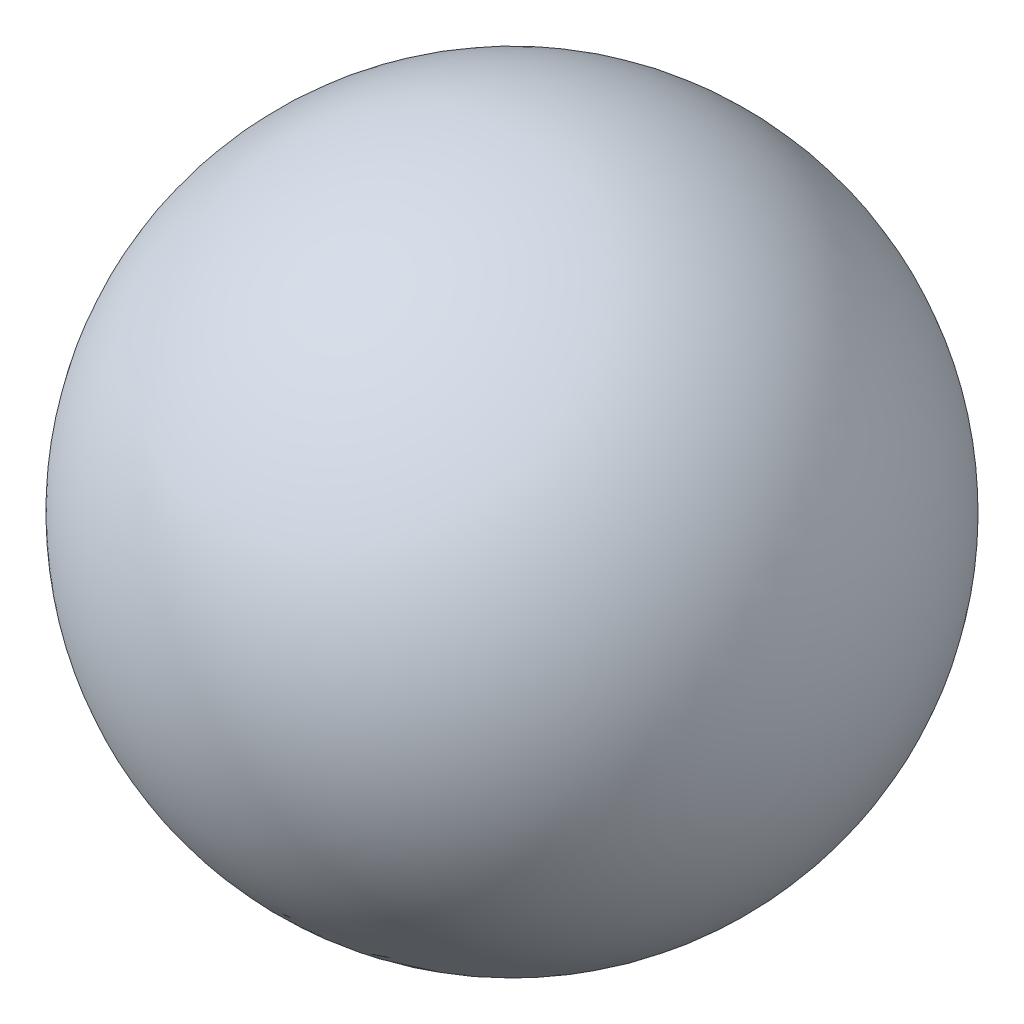
ISO-10303-21;
HEADER;
FILE_DESCRIPTION(('STEP AP214'),'2;1');
FILE_NAME('part.step','',(''),(''),'','','');
FILE_SCHEMA(('AUTOMOTIVE_DESIGN { 1 0 10303 214 1 1 1 1 }'));
ENDSEC;
DATA;
#1=APPLICATION_CONTEXT('core data for automotive mechanical design processes');
#2=APPLICATION_PROTOCOL_DEFINITION('international standard','automotive_design',2000,#1);
#3=PRODUCT_CONTEXT('',#1,'mechanical');
#4=PRODUCT('Part','Part','',(#3));
#5=PRODUCT_RELATED_PRODUCT_CATEGORY('part','',(#4));
#6=PRODUCT_DEFINITION_FORMATION('','',#4);
#7=PRODUCT_DEFINITION_CONTEXT('part definition',#1,'design');
#8=PRODUCT_DEFINITION('design','',#6,#7);
#9=PRODUCT_DEFINITION_SHAPE('','',#8);
#10=(LENGTH_UNIT() NAMED_UNIT(*) SI_UNIT(.MILLI.,.METRE.));
#11=(NAMED_UNIT(*) PLANE_ANGLE_UNIT() SI_UNIT($,.RADIAN.));
#12=(NAMED_UNIT(*) SI_UNIT($,.STERADIAN.) SOLID_ANGLE_UNIT());
#13=UNCERTAINTY_MEASURE_WITH_UNIT(LENGTH_MEASURE(1.E-05),#10,'distance_accuracy_value','');
#14=(GEOMETRIC_REPRESENTATION_CONTEXT(3) GLOBAL_UNCERTAINTY_ASSIGNED_CONTEXT((#13)) GLOBAL_UNIT_ASSIGNED_CONTEXT((#10,
#11,#12)) REPRESENTATION_CONTEXT('',''));
#15=CARTESIAN_POINT('',(0.,0.,0.));
#16=DIRECTION('',(0.,0.,1.));
#17=DIRECTION('',(1.,0.,0.));
#18=AXIS2_PLACEMENT_3D('',#15,#16,#17);
#19=CARTESIAN_POINT('',(57.535,24.0207803707955,56.6491624177093));
#20=DIRECTION('',(0.,0.390381842971411,0.920653038162719));
#21=DIRECTION('',(0.173648177666934,-0.906666249816889,0.38445106559344));
#22=AXIS2_PLACEMENT_3D('',#19,#20,#21);
#23=SPHERICAL_SURFACE('',#22,6.75);
#24=CARTESIAN_POINT('',(57.535,26.6558578108525,62.8635704253077));
#25=VERTEX_POINT('',#24);
#26=VERTEX_LOOP('',#25);
#27=FACE_BOUND('',#26,.T.);
#28=CARTESIAN_POINT('',(57.535,21.3857029307385,50.4347544101109));
#29=VERTEX_POINT('',#28);
#30=VERTEX_LOOP('',#29);
#31=FACE_BOUND('',#30,.T.);
#32=ADVANCED_FACE('F16',(#27,#31),#23,.T.);
#33=CLOSED_SHELL('',(#32));
#34=MANIFOLD_SOLID_BREP('B1',#33);
#35=ADVANCED_BREP_SHAPE_REPRESENTATION('',(#18,#34),#14);
#36=SHAPE_DEFINITION_REPRESENTATION(#9,#35);
ENDSEC;
END-ISO-10303-21;
